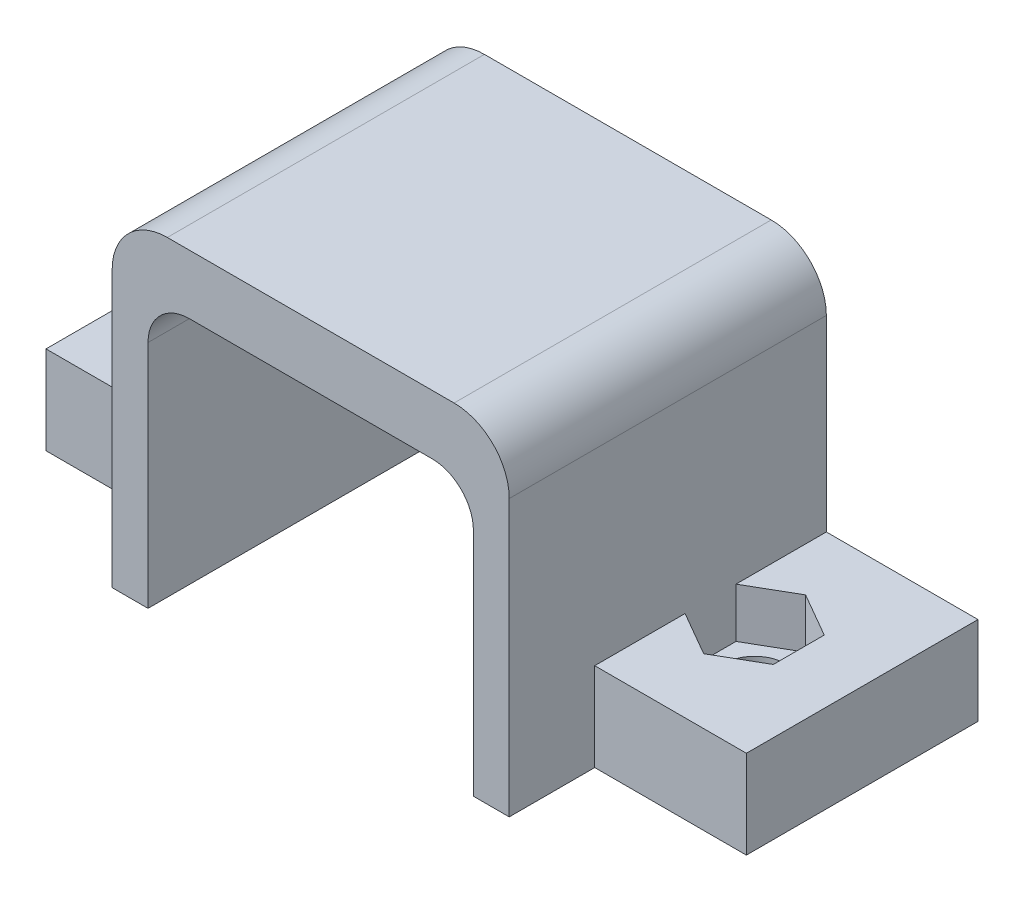
ISO-10303-21;
HEADER;
FILE_DESCRIPTION(('STEP AP214'),'2;1');
FILE_NAME('part.step','',(''),(''),'','','');
FILE_SCHEMA(('AUTOMOTIVE_DESIGN { 1 0 10303 214 1 1 1 1 }'));
ENDSEC;
DATA;
#1=APPLICATION_CONTEXT('core data for automotive mechanical design processes');
#2=APPLICATION_PROTOCOL_DEFINITION('international standard','automotive_design',2000,#1);
#3=PRODUCT_CONTEXT('',#1,'mechanical');
#4=PRODUCT('Part','Part','',(#3));
#5=PRODUCT_RELATED_PRODUCT_CATEGORY('part','',(#4));
#6=PRODUCT_DEFINITION_FORMATION('','',#4);
#7=PRODUCT_DEFINITION_CONTEXT('part definition',#1,'design');
#8=PRODUCT_DEFINITION('design','',#6,#7);
#9=PRODUCT_DEFINITION_SHAPE('','',#8);
#10=(LENGTH_UNIT() NAMED_UNIT(*) SI_UNIT(.MILLI.,.METRE.));
#11=(NAMED_UNIT(*) PLANE_ANGLE_UNIT() SI_UNIT($,.RADIAN.));
#12=(NAMED_UNIT(*) SI_UNIT($,.STERADIAN.) SOLID_ANGLE_UNIT());
#13=UNCERTAINTY_MEASURE_WITH_UNIT(LENGTH_MEASURE(1.E-05),#10,'distance_accuracy_value','');
#14=(GEOMETRIC_REPRESENTATION_CONTEXT(3) GLOBAL_UNCERTAINTY_ASSIGNED_CONTEXT((#13)) GLOBAL_UNIT_ASSIGNED_CONTEXT((#10,
#11,#12)) REPRESENTATION_CONTEXT('',''));
#15=CARTESIAN_POINT('',(0.,0.,0.));
#16=DIRECTION('',(0.,0.,1.));
#17=DIRECTION('',(1.,0.,0.));
#18=AXIS2_PLACEMENT_3D('',#15,#16,#17);
#19=CARTESIAN_POINT('',(16.,0.,4.2));
#20=DIRECTION('',(0.,1.,0.));
#21=DIRECTION('',(0.,0.,1.));
#22=AXIS2_PLACEMENT_3D('',#19,#20,#21);
#23=CYLINDRICAL_SURFACE('',#22,1.125);
#24=CARTESIAN_POINT('',(16.,0.,4.2));
#25=DIRECTION('',(0.,1.,0.));
#26=DIRECTION('',(0.,0.,1.));
#27=AXIS2_PLACEMENT_3D('',#24,#25,#26);
#28=CIRCLE('',#27,1.125);
#29=CARTESIAN_POINT('',(16.,0.,5.325));
#30=VERTEX_POINT('',#29);
#31=EDGE_CURVE('E382',#30,#30,#28,.T.);
#32=ORIENTED_EDGE('',*,*,#31,.F.);
#33=EDGE_LOOP('',(#32));
#34=FACE_BOUND('',#33,.T.);
#35=CARTESIAN_POINT('',(16.,1.4,4.2));
#36=DIRECTION('',(0.,1.,0.));
#37=DIRECTION('',(0.,0.,1.));
#38=AXIS2_PLACEMENT_3D('',#35,#36,#37);
#39=CIRCLE('',#38,1.125);
#40=CARTESIAN_POINT('',(16.,1.4,5.325));
#41=VERTEX_POINT('',#40);
#42=EDGE_CURVE('E386',#41,#41,#39,.F.);
#43=ORIENTED_EDGE('',*,*,#42,.F.);
#44=EDGE_LOOP('',(#43));
#45=FACE_BOUND('',#44,.T.);
#46=ADVANCED_FACE('F43',(#34,#45),#23,.F.);
#47=CARTESIAN_POINT('',(-1.6,0.,4.2));
#48=DIRECTION('',(0.,1.,0.));
#49=DIRECTION('',(0.,0.,1.));
#50=AXIS2_PLACEMENT_3D('',#47,#48,#49);
#51=CYLINDRICAL_SURFACE('',#50,1.125);
#52=CARTESIAN_POINT('',(-1.6,0.,4.2));
#53=DIRECTION('',(0.,1.,0.));
#54=DIRECTION('',(0.,0.,1.));
#55=AXIS2_PLACEMENT_3D('',#52,#53,#54);
#56=CIRCLE('',#55,1.125);
#57=CARTESIAN_POINT('',(-1.6,0.,5.325));
#58=VERTEX_POINT('',#57);
#59=EDGE_CURVE('E377',#58,#58,#56,.T.);
#60=ORIENTED_EDGE('',*,*,#59,.F.);
#61=EDGE_LOOP('',(#60));
#62=FACE_BOUND('',#61,.T.);
#63=CARTESIAN_POINT('',(-1.6,1.4,4.2));
#64=DIRECTION('',(0.,1.,0.));
#65=DIRECTION('',(0.,0.,1.));
#66=AXIS2_PLACEMENT_3D('',#63,#64,#65);
#67=CIRCLE('',#66,1.125);
#68=CARTESIAN_POINT('',(-1.6,1.4,5.325));
#69=VERTEX_POINT('',#68);
#70=EDGE_CURVE('E304',#69,#69,#67,.F.);
#71=ORIENTED_EDGE('',*,*,#70,.F.);
#72=EDGE_LOOP('',(#71));
#73=FACE_BOUND('',#72,.T.);
#74=ADVANCED_FACE('F690',(#62,#73),#51,.F.);
#75=CARTESIAN_POINT('',(14.4,0.,11.5));
#76=DIRECTION('',(-1.,0.,0.));
#77=DIRECTION('',(0.,0.,1.));
#78=AXIS2_PLACEMENT_3D('',#75,#76,#77);
#79=PLANE('',#78);
#80=DIRECTION('',(0.,1.,0.));
#81=VECTOR('',#80,1.);
#82=CARTESIAN_POINT('',(14.4,0.,0.));
#83=LINE('',#82,#81);
#84=CARTESIAN_POINT('',(14.4,3.2,0.));
#85=VERTEX_POINT('',#84);
#86=CARTESIAN_POINT('',(14.4,10.,0.));
#87=VERTEX_POINT('',#86);
#88=EDGE_CURVE('E505',#85,#87,#83,.T.);
#89=ORIENTED_EDGE('',*,*,#88,.T.);
#90=DIRECTION('',(0.,0.,-1.));
#91=VECTOR('',#90,1.);
#92=CARTESIAN_POINT('',(14.4,10.,11.5));
#93=LINE('',#92,#91);
#94=CARTESIAN_POINT('',(14.4,10.,11.5));
#95=VERTEX_POINT('',#94);
#96=EDGE_CURVE('E546',#87,#95,#93,.F.);
#97=ORIENTED_EDGE('',*,*,#96,.T.);
#98=DIRECTION('',(0.,1.,0.));
#99=VECTOR('',#98,1.);
#100=CARTESIAN_POINT('',(14.4,0.,11.5));
#101=LINE('',#100,#99);
#102=CARTESIAN_POINT('',(14.4,0.,11.5));
#103=VERTEX_POINT('',#102);
#104=EDGE_CURVE('E478',#103,#95,#101,.T.);
#105=ORIENTED_EDGE('',*,*,#104,.F.);
#106=DIRECTION('',(0.,0.,-1.));
#107=VECTOR('',#106,1.);
#108=CARTESIAN_POINT('',(14.4,0.,11.5));
#109=LINE('',#108,#107);
#110=CARTESIAN_POINT('',(14.4,0.,8.4));
#111=VERTEX_POINT('',#110);
#112=EDGE_CURVE('E486',#103,#111,#109,.T.);
#113=ORIENTED_EDGE('',*,*,#112,.T.);
#114=DIRECTION('',(0.,-1.,0.));
#115=VECTOR('',#114,1.);
#116=CARTESIAN_POINT('',(14.4,3.2,8.4));
#117=LINE('',#116,#115);
#118=CARTESIAN_POINT('',(14.4,3.2,8.4));
#119=VERTEX_POINT('',#118);
#120=EDGE_CURVE('E381',#119,#111,#117,.T.);
#121=ORIENTED_EDGE('',*,*,#120,.F.);
#122=DIRECTION('',(0.,0.,-1.));
#123=VECTOR('',#122,1.);
#124=CARTESIAN_POINT('',(14.4,3.2,0.));
#125=LINE('',#124,#123);
#126=CARTESIAN_POINT('',(14.4,3.2,5.1237604307034));
#127=VERTEX_POINT('',#126);
#128=EDGE_CURVE('E402',#119,#127,#125,.T.);
#129=ORIENTED_EDGE('',*,*,#128,.T.);
#130=DIRECTION('',(0.,1.,0.));
#131=VECTOR('',#130,1.);
#132=CARTESIAN_POINT('',(14.4,1.4,5.1237604307034));
#133=LINE('',#132,#131);
#134=CARTESIAN_POINT('',(14.4,1.4,5.1237604307034));
#135=VERTEX_POINT('',#134);
#136=EDGE_CURVE('E324',#135,#127,#133,.T.);
#137=ORIENTED_EDGE('',*,*,#136,.F.);
#138=DIRECTION('',(0.,0.,1.));
#139=VECTOR('',#138,1.);
#140=CARTESIAN_POINT('',(14.4,1.4,3.2762395692966));
#141=LINE('',#140,#139);
#142=CARTESIAN_POINT('',(14.4,1.4,3.2762395692966));
#143=VERTEX_POINT('',#142);
#144=EDGE_CURVE('E366',#143,#135,#141,.T.);
#145=ORIENTED_EDGE('',*,*,#144,.F.);
#146=DIRECTION('',(0.,1.,0.));
#147=VECTOR('',#146,1.);
#148=CARTESIAN_POINT('',(14.4,1.4,3.2762395692966));
#149=LINE('',#148,#147);
#150=CARTESIAN_POINT('',(14.4,3.2,3.2762395692966));
#151=VERTEX_POINT('',#150);
#152=EDGE_CURVE('E321',#143,#151,#149,.T.);
#153=ORIENTED_EDGE('',*,*,#152,.T.);
#154=EDGE_CURVE('E418',#151,#85,#125,.T.);
#155=ORIENTED_EDGE('',*,*,#154,.T.);
#156=EDGE_LOOP('',(#89,#97,#105,#113,#121,#129,#137,#145,#153,#155));
#157=FACE_BOUND('',#156,.T.);
#158=ADVANCED_FACE('F583',(#157),#79,.F.);
#159=CARTESIAN_POINT('',(0.,0.,11.5));
#160=DIRECTION('',(1.,0.,0.));
#161=DIRECTION('',(0.,0.,-1.));
#162=AXIS2_PLACEMENT_3D('',#159,#160,#161);
#163=PLANE('',#162);
#164=DIRECTION('',(0.,-1.,0.));
#165=VECTOR('',#164,1.);
#166=CARTESIAN_POINT('',(0.,0.,11.5));
#167=LINE('',#166,#165);
#168=CARTESIAN_POINT('',(0.,10.,11.5));
#169=VERTEX_POINT('',#168);
#170=CARTESIAN_POINT('',(0.,0.,11.5));
#171=VERTEX_POINT('',#170);
#172=EDGE_CURVE('E458',#169,#171,#167,.T.);
#173=ORIENTED_EDGE('',*,*,#172,.F.);
#174=DIRECTION('',(0.,0.,-1.));
#175=VECTOR('',#174,1.);
#176=CARTESIAN_POINT('',(0.,10.,11.5));
#177=LINE('',#176,#175);
#178=CARTESIAN_POINT('',(0.,10.,0.));
#179=VERTEX_POINT('',#178);
#180=EDGE_CURVE('E555',#169,#179,#177,.T.);
#181=ORIENTED_EDGE('',*,*,#180,.T.);
#182=DIRECTION('',(0.,-1.,0.));
#183=VECTOR('',#182,1.);
#184=CARTESIAN_POINT('',(0.,0.,0.));
#185=LINE('',#184,#183);
#186=CARTESIAN_POINT('',(0.,3.2,0.));
#187=VERTEX_POINT('',#186);
#188=EDGE_CURVE('E451',#179,#187,#185,.T.);
#189=ORIENTED_EDGE('',*,*,#188,.T.);
#190=DIRECTION('',(0.,0.,1.));
#191=VECTOR('',#190,1.);
#192=CARTESIAN_POINT('',(0.,3.2,0.));
#193=LINE('',#192,#191);
#194=CARTESIAN_POINT('',(0.,3.2,3.2762395692966));
#195=VERTEX_POINT('',#194);
#196=EDGE_CURVE('E422',#187,#195,#193,.T.);
#197=ORIENTED_EDGE('',*,*,#196,.T.);
#198=DIRECTION('',(0.,1.,0.));
#199=VECTOR('',#198,1.);
#200=CARTESIAN_POINT('',(0.,1.4,3.2762395692966));
#201=LINE('',#200,#199);
#202=CARTESIAN_POINT('',(0.,1.4,3.2762395692966));
#203=VERTEX_POINT('',#202);
#204=EDGE_CURVE('E301',#203,#195,#201,.T.);
#205=ORIENTED_EDGE('',*,*,#204,.F.);
#206=DIRECTION('',(0.,0.,-1.));
#207=VECTOR('',#206,1.);
#208=CARTESIAN_POINT('',(0.,1.4,5.12376043070341));
#209=LINE('',#208,#207);
#210=CARTESIAN_POINT('',(0.,1.4,5.12376043070341));
#211=VERTEX_POINT('',#210);
#212=EDGE_CURVE('E254',#211,#203,#209,.T.);
#213=ORIENTED_EDGE('',*,*,#212,.F.);
#214=DIRECTION('',(0.,1.,0.));
#215=VECTOR('',#214,1.);
#216=CARTESIAN_POINT('',(0.,1.4,5.12376043070341));
#217=LINE('',#216,#215);
#218=CARTESIAN_POINT('',(0.,3.2,5.12376043070341));
#219=VERTEX_POINT('',#218);
#220=EDGE_CURVE('E305',#211,#219,#217,.T.);
#221=ORIENTED_EDGE('',*,*,#220,.T.);
#222=CARTESIAN_POINT('',(0.,3.2,8.4));
#223=VERTEX_POINT('',#222);
#224=EDGE_CURVE('E427',#219,#223,#193,.T.);
#225=ORIENTED_EDGE('',*,*,#224,.T.);
#226=DIRECTION('',(0.,-1.,0.));
#227=VECTOR('',#226,1.);
#228=CARTESIAN_POINT('',(0.,3.2,8.4));
#229=LINE('',#228,#227);
#230=CARTESIAN_POINT('',(0.,0.,8.4));
#231=VERTEX_POINT('',#230);
#232=EDGE_CURVE('E439',#223,#231,#229,.T.);
#233=ORIENTED_EDGE('',*,*,#232,.T.);
#234=DIRECTION('',(0.,0.,-1.));
#235=VECTOR('',#234,1.);
#236=CARTESIAN_POINT('',(0.,0.,11.5));
#237=LINE('',#236,#235);
#238=EDGE_CURVE('E523',#171,#231,#237,.T.);
#239=ORIENTED_EDGE('',*,*,#238,.F.);
#240=EDGE_LOOP('',(#173,#181,#189,#197,#205,#213,#221,#225,#233,#239));
#241=FACE_BOUND('',#240,.T.);
#242=ADVANCED_FACE('F612',(#241),#163,.F.);
#243=CARTESIAN_POINT('',(0.,0.,11.5));
#244=DIRECTION('',(0.,1.,0.));
#245=DIRECTION('',(0.,0.,1.));
#246=AXIS2_PLACEMENT_3D('',#243,#244,#245);
#247=PLANE('',#246);
#248=ORIENTED_EDGE('',*,*,#59,.T.);
#249=EDGE_LOOP('',(#248));
#250=FACE_BOUND('',#249,.T.);
#251=DIRECTION('',(1.,0.,0.));
#252=VECTOR('',#251,1.);
#253=CARTESIAN_POINT('',(0.,0.,0.));
#254=LINE('',#253,#252);
#255=CARTESIAN_POINT('',(-5.5,0.,0.));
#256=VERTEX_POINT('',#255);
#257=CARTESIAN_POINT('',(1.3,0.,0.));
#258=VERTEX_POINT('',#257);
#259=EDGE_CURVE('E489',#256,#258,#254,.T.);
#260=ORIENTED_EDGE('',*,*,#259,.T.);
#261=DIRECTION('',(0.,0.,-1.));
#262=VECTOR('',#261,1.);
#263=CARTESIAN_POINT('',(1.3,0.,11.5));
#264=LINE('',#263,#262);
#265=CARTESIAN_POINT('',(1.3,0.,11.5));
#266=VERTEX_POINT('',#265);
#267=EDGE_CURVE('E519',#266,#258,#264,.T.);
#268=ORIENTED_EDGE('',*,*,#267,.F.);
#269=DIRECTION('',(1.,0.,0.));
#270=VECTOR('',#269,1.);
#271=CARTESIAN_POINT('',(0.,0.,11.5));
#272=LINE('',#271,#270);
#273=EDGE_CURVE('E461',#171,#266,#272,.T.);
#274=ORIENTED_EDGE('',*,*,#273,.F.);
#275=ORIENTED_EDGE('',*,*,#238,.T.);
#276=DIRECTION('',(-1.,0.,0.));
#277=VECTOR('',#276,1.);
#278=CARTESIAN_POINT('',(0.,0.,8.4));
#279=LINE('',#278,#277);
#280=CARTESIAN_POINT('',(-5.5,0.,8.4));
#281=VERTEX_POINT('',#280);
#282=EDGE_CURVE('E406',#231,#281,#279,.T.);
#283=ORIENTED_EDGE('',*,*,#282,.T.);
#284=DIRECTION('',(0.,0.,-1.));
#285=VECTOR('',#284,1.);
#286=CARTESIAN_POINT('',(-5.5,0.,0.));
#287=LINE('',#286,#285);
#288=EDGE_CURVE('E443',#281,#256,#287,.T.);
#289=ORIENTED_EDGE('',*,*,#288,.T.);
#290=EDGE_LOOP('',(#260,#268,#274,#275,#283,#289));
#291=FACE_BOUND('',#290,.T.);
#292=ADVANCED_FACE('F632',(#250,#291),#247,.F.);
#293=CARTESIAN_POINT('',(1.3,0.,11.5));
#294=DIRECTION('',(-1.,0.,0.));
#295=DIRECTION('',(0.,0.,1.));
#296=AXIS2_PLACEMENT_3D('',#293,#294,#295);
#297=PLANE('',#296);
#298=DIRECTION('',(0.,1.,0.));
#299=VECTOR('',#298,1.);
#300=CARTESIAN_POINT('',(1.3,0.,0.));
#301=LINE('',#300,#299);
#302=CARTESIAN_POINT('',(1.3,8.35,0.));
#303=VERTEX_POINT('',#302);
#304=EDGE_CURVE('E492',#258,#303,#301,.T.);
#305=ORIENTED_EDGE('',*,*,#304,.T.);
#306=DIRECTION('',(0.,0.,-1.));
#307=VECTOR('',#306,1.);
#308=CARTESIAN_POINT('',(1.3,8.35,11.5));
#309=LINE('',#308,#307);
#310=CARTESIAN_POINT('',(1.3,8.35,11.5));
#311=VERTEX_POINT('',#310);
#312=EDGE_CURVE('E59',#303,#311,#309,.F.);
#313=ORIENTED_EDGE('',*,*,#312,.T.);
#314=DIRECTION('',(0.,1.,0.));
#315=VECTOR('',#314,1.);
#316=CARTESIAN_POINT('',(1.3,0.,11.5));
#317=LINE('',#316,#315);
#318=EDGE_CURVE('E465',#266,#311,#317,.T.);
#319=ORIENTED_EDGE('',*,*,#318,.F.);
#320=ORIENTED_EDGE('',*,*,#267,.T.);
#321=EDGE_LOOP('',(#305,#313,#319,#320));
#322=FACE_BOUND('',#321,.T.);
#323=ADVANCED_FACE('F733',(#322),#297,.F.);
#324=CARTESIAN_POINT('',(1.3,9.85,11.5));
#325=DIRECTION('',(0.,1.,0.));
#326=DIRECTION('',(0.,0.,1.));
#327=AXIS2_PLACEMENT_3D('',#324,#325,#326);
#328=PLANE('',#327);
#329=DIRECTION('',(1.,0.,0.));
#330=VECTOR('',#329,1.);
#331=CARTESIAN_POINT('',(1.3,9.85,0.));
#332=LINE('',#331,#330);
#333=CARTESIAN_POINT('',(2.8,9.85,0.));
#334=VERTEX_POINT('',#333);
#335=CARTESIAN_POINT('',(11.6,9.85,0.));
#336=VERTEX_POINT('',#335);
#337=EDGE_CURVE('E495',#334,#336,#332,.T.);
#338=ORIENTED_EDGE('',*,*,#337,.T.);
#339=DIRECTION('',(0.,0.,-1.));
#340=VECTOR('',#339,1.);
#341=CARTESIAN_POINT('',(11.6,9.85,11.5));
#342=LINE('',#341,#340);
#343=CARTESIAN_POINT('',(11.6,9.85,11.5));
#344=VERTEX_POINT('',#343);
#345=EDGE_CURVE('E567',#336,#344,#342,.F.);
#346=ORIENTED_EDGE('',*,*,#345,.T.);
#347=DIRECTION('',(1.,0.,0.));
#348=VECTOR('',#347,1.);
#349=CARTESIAN_POINT('',(1.3,9.85,11.5));
#350=LINE('',#349,#348);
#351=CARTESIAN_POINT('',(2.8,9.85,11.5));
#352=VERTEX_POINT('',#351);
#353=EDGE_CURVE('E468',#352,#344,#350,.T.);
#354=ORIENTED_EDGE('',*,*,#353,.F.);
#355=DIRECTION('',(0.,0.,-1.));
#356=VECTOR('',#355,1.);
#357=CARTESIAN_POINT('',(2.8,9.85,0.));
#358=LINE('',#357,#356);
#359=EDGE_CURVE('E563',#352,#334,#358,.T.);
#360=ORIENTED_EDGE('',*,*,#359,.T.);
#361=EDGE_LOOP('',(#338,#346,#354,#360));
#362=FACE_BOUND('',#361,.T.);
#363=ADVANCED_FACE('F639',(#362),#328,.F.);
#364=CARTESIAN_POINT('',(13.1,0.,11.5));
#365=DIRECTION('',(1.,0.,0.));
#366=DIRECTION('',(0.,0.,-1.));
#367=AXIS2_PLACEMENT_3D('',#364,#365,#366);
#368=PLANE('',#367);
#369=DIRECTION('',(0.,-1.,0.));
#370=VECTOR('',#369,1.);
#371=CARTESIAN_POINT('',(13.1,0.,11.5));
#372=LINE('',#371,#370);
#373=CARTESIAN_POINT('',(13.1,8.35,11.5));
#374=VERTEX_POINT('',#373);
#375=CARTESIAN_POINT('',(13.1,0.,11.5));
#376=VERTEX_POINT('',#375);
#377=EDGE_CURVE('E472',#374,#376,#372,.T.);
#378=ORIENTED_EDGE('',*,*,#377,.F.);
#379=DIRECTION('',(0.,0.,-1.));
#380=VECTOR('',#379,1.);
#381=CARTESIAN_POINT('',(13.1,8.35,0.));
#382=LINE('',#381,#380);
#383=CARTESIAN_POINT('',(13.1,8.35,0.));
#384=VERTEX_POINT('',#383);
#385=EDGE_CURVE('E559',#374,#384,#382,.T.);
#386=ORIENTED_EDGE('',*,*,#385,.T.);
#387=DIRECTION('',(0.,-1.,0.));
#388=VECTOR('',#387,1.);
#389=CARTESIAN_POINT('',(13.1,0.,0.));
#390=LINE('',#389,#388);
#391=CARTESIAN_POINT('',(13.1,0.,0.));
#392=VERTEX_POINT('',#391);
#393=EDGE_CURVE('E499',#384,#392,#390,.T.);
#394=ORIENTED_EDGE('',*,*,#393,.T.);
#395=DIRECTION('',(0.,0.,-1.));
#396=VECTOR('',#395,1.);
#397=CARTESIAN_POINT('',(13.1,0.,11.5));
#398=LINE('',#397,#396);
#399=EDGE_CURVE('E515',#376,#392,#398,.T.);
#400=ORIENTED_EDGE('',*,*,#399,.F.);
#401=EDGE_LOOP('',(#378,#386,#394,#400));
#402=FACE_BOUND('',#401,.T.);
#403=ADVANCED_FACE('F649',(#402),#368,.F.);
#404=CARTESIAN_POINT('',(13.1,0.,11.5));
#405=DIRECTION('',(0.,1.,0.));
#406=DIRECTION('',(0.,0.,1.));
#407=AXIS2_PLACEMENT_3D('',#404,#405,#406);
#408=PLANE('',#407);
#409=ORIENTED_EDGE('',*,*,#31,.T.);
#410=EDGE_LOOP('',(#409));
#411=FACE_BOUND('',#410,.T.);
#412=DIRECTION('',(1.,0.,0.));
#413=VECTOR('',#412,1.);
#414=CARTESIAN_POINT('',(13.1,0.,0.));
#415=LINE('',#414,#413);
#416=CARTESIAN_POINT('',(19.9,0.,0.));
#417=VERTEX_POINT('',#416);
#418=EDGE_CURVE('E502',#392,#417,#415,.T.);
#419=ORIENTED_EDGE('',*,*,#418,.T.);
#420=DIRECTION('',(0.,0.,1.));
#421=VECTOR('',#420,1.);
#422=CARTESIAN_POINT('',(19.9,0.,0.));
#423=LINE('',#422,#421);
#424=CARTESIAN_POINT('',(19.9,0.,8.4));
#425=VERTEX_POINT('',#424);
#426=EDGE_CURVE('E401',#417,#425,#423,.T.);
#427=ORIENTED_EDGE('',*,*,#426,.T.);
#428=DIRECTION('',(-1.,0.,0.));
#429=VECTOR('',#428,1.);
#430=CARTESIAN_POINT('',(14.4,0.,8.4));
#431=LINE('',#430,#429);
#432=EDGE_CURVE('E397',#425,#111,#431,.T.);
#433=ORIENTED_EDGE('',*,*,#432,.T.);
#434=ORIENTED_EDGE('',*,*,#112,.F.);
#435=DIRECTION('',(1.,0.,0.));
#436=VECTOR('',#435,1.);
#437=CARTESIAN_POINT('',(13.1,0.,11.5));
#438=LINE('',#437,#436);
#439=EDGE_CURVE('E475',#376,#103,#438,.T.);
#440=ORIENTED_EDGE('',*,*,#439,.F.);
#441=ORIENTED_EDGE('',*,*,#399,.T.);
#442=EDGE_LOOP('',(#419,#427,#433,#434,#440,#441));
#443=FACE_BOUND('',#442,.T.);
#444=ADVANCED_FACE('F655',(#411,#443),#408,.F.);
#445=CARTESIAN_POINT('',(0.,12.,11.5));
#446=DIRECTION('',(0.,-1.,0.));
#447=DIRECTION('',(0.,0.,-1.));
#448=AXIS2_PLACEMENT_3D('',#445,#446,#447);
#449=PLANE('',#448);
#450=DIRECTION('',(-1.,0.,0.));
#451=VECTOR('',#450,1.);
#452=CARTESIAN_POINT('',(0.,12.,11.5));
#453=LINE('',#452,#451);
#454=CARTESIAN_POINT('',(12.4,12.,11.5));
#455=VERTEX_POINT('',#454);
#456=CARTESIAN_POINT('',(2.,12.,11.5));
#457=VERTEX_POINT('',#456);
#458=EDGE_CURVE('E482',#455,#457,#453,.T.);
#459=ORIENTED_EDGE('',*,*,#458,.F.);
#460=DIRECTION('',(0.,0.,-1.));
#461=VECTOR('',#460,1.);
#462=CARTESIAN_POINT('',(12.4,12.,11.5));
#463=LINE('',#462,#461);
#464=CARTESIAN_POINT('',(12.4,12.,0.));
#465=VERTEX_POINT('',#464);
#466=EDGE_CURVE('E536',#455,#465,#463,.T.);
#467=ORIENTED_EDGE('',*,*,#466,.T.);
#468=DIRECTION('',(-1.,0.,0.));
#469=VECTOR('',#468,1.);
#470=CARTESIAN_POINT('',(0.,12.,0.));
#471=LINE('',#470,#469);
#472=CARTESIAN_POINT('',(2.,12.,0.));
#473=VERTEX_POINT('',#472);
#474=EDGE_CURVE('E462',#465,#473,#471,.T.);
#475=ORIENTED_EDGE('',*,*,#474,.T.);
#476=DIRECTION('',(0.,0.,-1.));
#477=VECTOR('',#476,1.);
#478=CARTESIAN_POINT('',(2.,12.,11.5));
#479=LINE('',#478,#477);
#480=EDGE_CURVE('E527',#473,#457,#479,.F.);
#481=ORIENTED_EDGE('',*,*,#480,.T.);
#482=EDGE_LOOP('',(#459,#467,#475,#481));
#483=FACE_BOUND('',#482,.T.);
#484=ADVANCED_FACE('F601',(#483),#449,.F.);
#485=CARTESIAN_POINT('',(0.,0.,11.5));
#486=DIRECTION('',(0.,0.,-1.));
#487=DIRECTION('',(-1.,0.,0.));
#488=AXIS2_PLACEMENT_3D('',#485,#486,#487);
#489=PLANE('',#488);
#490=ORIENTED_EDGE('',*,*,#104,.T.);
#491=CARTESIAN_POINT('',(12.4,10.,11.5));
#492=DIRECTION('',(0.,0.,-1.));
#493=DIRECTION('',(-1.,0.,0.));
#494=AXIS2_PLACEMENT_3D('',#491,#492,#493);
#495=CIRCLE('',#494,2.);
#496=EDGE_CURVE('E552',#95,#455,#495,.F.);
#497=ORIENTED_EDGE('',*,*,#496,.T.);
#498=ORIENTED_EDGE('',*,*,#458,.T.);
#499=CARTESIAN_POINT('',(2.,10.,11.5));
#500=DIRECTION('',(0.,0.,-1.));
#501=DIRECTION('',(-1.,0.,0.));
#502=AXIS2_PLACEMENT_3D('',#499,#500,#501);
#503=CIRCLE('',#502,2.);
#504=EDGE_CURVE('E549',#457,#169,#503,.F.);
#505=ORIENTED_EDGE('',*,*,#504,.T.);
#506=ORIENTED_EDGE('',*,*,#172,.T.);
#507=ORIENTED_EDGE('',*,*,#273,.T.);
#508=ORIENTED_EDGE('',*,*,#318,.T.);
#509=CARTESIAN_POINT('',(2.8,8.35,11.5));
#510=DIRECTION('',(0.,0.,-1.));
#511=DIRECTION('',(-1.,0.,0.));
#512=AXIS2_PLACEMENT_3D('',#509,#510,#511);
#513=CIRCLE('',#512,1.5);
#514=EDGE_CURVE('E11',#311,#352,#513,.T.);
#515=ORIENTED_EDGE('',*,*,#514,.T.);
#516=ORIENTED_EDGE('',*,*,#353,.T.);
#517=CARTESIAN_POINT('',(11.6,8.35,11.5));
#518=DIRECTION('',(0.,0.,-1.));
#519=DIRECTION('',(-1.,0.,0.));
#520=AXIS2_PLACEMENT_3D('',#517,#518,#519);
#521=CIRCLE('',#520,1.5);
#522=EDGE_CURVE('E575',#344,#374,#521,.T.);
#523=ORIENTED_EDGE('',*,*,#522,.T.);
#524=ORIENTED_EDGE('',*,*,#377,.T.);
#525=ORIENTED_EDGE('',*,*,#439,.T.);
#526=EDGE_LOOP('',(#490,#497,#498,#505,#506,#507,#508,#515,#516,#523,#524,#525));
#527=FACE_BOUND('',#526,.T.);
#528=ADVANCED_FACE('F605',(#527),#489,.F.);
#529=CARTESIAN_POINT('',(0.,0.,0.));
#530=DIRECTION('',(0.,0.,-1.));
#531=DIRECTION('',(-1.,0.,0.));
#532=AXIS2_PLACEMENT_3D('',#529,#530,#531);
#533=PLANE('',#532);
#534=ORIENTED_EDGE('',*,*,#474,.F.);
#535=CARTESIAN_POINT('',(12.4,10.,0.));
#536=DIRECTION('',(0.,0.,-1.));
#537=DIRECTION('',(-1.,0.,0.));
#538=AXIS2_PLACEMENT_3D('',#535,#536,#537);
#539=CIRCLE('',#538,2.);
#540=EDGE_CURVE('E543',#465,#87,#539,.T.);
#541=ORIENTED_EDGE('',*,*,#540,.T.);
#542=ORIENTED_EDGE('',*,*,#88,.F.);
#543=DIRECTION('',(1.,0.,0.));
#544=VECTOR('',#543,1.);
#545=CARTESIAN_POINT('',(14.4,3.2,0.));
#546=LINE('',#545,#544);
#547=CARTESIAN_POINT('',(19.9,3.2,0.));
#548=VERTEX_POINT('',#547);
#549=EDGE_CURVE('E414',#85,#548,#546,.T.);
#550=ORIENTED_EDGE('',*,*,#549,.T.);
#551=DIRECTION('',(0.,-1.,0.));
#552=VECTOR('',#551,1.);
#553=CARTESIAN_POINT('',(19.9,3.2,0.));
#554=LINE('',#553,#552);
#555=EDGE_CURVE('E387',#548,#417,#554,.T.);
#556=ORIENTED_EDGE('',*,*,#555,.T.);
#557=ORIENTED_EDGE('',*,*,#418,.F.);
#558=ORIENTED_EDGE('',*,*,#393,.F.);
#559=CARTESIAN_POINT('',(11.6,8.35,0.));
#560=DIRECTION('',(0.,0.,-1.));
#561=DIRECTION('',(-1.,0.,0.));
#562=AXIS2_PLACEMENT_3D('',#559,#560,#561);
#563=CIRCLE('',#562,1.5);
#564=EDGE_CURVE('E572',#384,#336,#563,.F.);
#565=ORIENTED_EDGE('',*,*,#564,.T.);
#566=ORIENTED_EDGE('',*,*,#337,.F.);
#567=CARTESIAN_POINT('',(2.8,8.35,0.));
#568=DIRECTION('',(0.,0.,-1.));
#569=DIRECTION('',(-1.,0.,0.));
#570=AXIS2_PLACEMENT_3D('',#567,#568,#569);
#571=CIRCLE('',#570,1.5);
#572=EDGE_CURVE('E52',#334,#303,#571,.F.);
#573=ORIENTED_EDGE('',*,*,#572,.T.);
#574=ORIENTED_EDGE('',*,*,#304,.F.);
#575=ORIENTED_EDGE('',*,*,#259,.F.);
#576=DIRECTION('',(0.,-1.,0.));
#577=VECTOR('',#576,1.);
#578=CARTESIAN_POINT('',(-5.5,3.2,0.));
#579=LINE('',#578,#577);
#580=CARTESIAN_POINT('',(-5.5,3.2,0.));
#581=VERTEX_POINT('',#580);
#582=EDGE_CURVE('E447',#581,#256,#579,.T.);
#583=ORIENTED_EDGE('',*,*,#582,.F.);
#584=DIRECTION('',(1.,0.,0.));
#585=VECTOR('',#584,1.);
#586=CARTESIAN_POINT('',(0.,3.2,0.));
#587=LINE('',#586,#585);
#588=EDGE_CURVE('E435',#581,#187,#587,.T.);
#589=ORIENTED_EDGE('',*,*,#588,.T.);
#590=ORIENTED_EDGE('',*,*,#188,.F.);
#591=CARTESIAN_POINT('',(2.,10.,0.));
#592=DIRECTION('',(0.,0.,-1.));
#593=DIRECTION('',(-1.,0.,0.));
#594=AXIS2_PLACEMENT_3D('',#591,#592,#593);
#595=CIRCLE('',#594,2.);
#596=EDGE_CURVE('E540',#179,#473,#595,.T.);
#597=ORIENTED_EDGE('',*,*,#596,.T.);
#598=EDGE_LOOP('',(#534,#541,#542,#550,#556,#557,#558,#565,#566,#573,#574,#575,#583,#589,#590,#597));
#599=FACE_BOUND('',#598,.T.);
#600=ADVANCED_FACE('F594',(#599),#533,.T.);
#601=CARTESIAN_POINT('',(-5.5,3.2,0.));
#602=DIRECTION('',(-1.,0.,0.));
#603=DIRECTION('',(0.,0.,1.));
#604=AXIS2_PLACEMENT_3D('',#601,#602,#603);
#605=PLANE('',#604);
#606=ORIENTED_EDGE('',*,*,#288,.F.);
#607=DIRECTION('',(0.,-1.,0.));
#608=VECTOR('',#607,1.);
#609=CARTESIAN_POINT('',(-5.5,3.2,8.4));
#610=LINE('',#609,#608);
#611=CARTESIAN_POINT('',(-5.5,3.2,8.4));
#612=VERTEX_POINT('',#611);
#613=EDGE_CURVE('E452',#612,#281,#610,.T.);
#614=ORIENTED_EDGE('',*,*,#613,.F.);
#615=DIRECTION('',(0.,0.,-1.));
#616=VECTOR('',#615,1.);
#617=CARTESIAN_POINT('',(-5.5,3.2,0.));
#618=LINE('',#617,#616);
#619=EDGE_CURVE('E431',#612,#581,#618,.T.);
#620=ORIENTED_EDGE('',*,*,#619,.T.);
#621=ORIENTED_EDGE('',*,*,#582,.T.);
#622=EDGE_LOOP('',(#606,#614,#620,#621));
#623=FACE_BOUND('',#622,.T.);
#624=ADVANCED_FACE('F712',(#623),#605,.T.);
#625=CARTESIAN_POINT('',(0.,3.2,8.4));
#626=DIRECTION('',(0.,0.,1.));
#627=DIRECTION('',(1.,0.,0.));
#628=AXIS2_PLACEMENT_3D('',#625,#626,#627);
#629=PLANE('',#628);
#630=ORIENTED_EDGE('',*,*,#282,.F.);
#631=ORIENTED_EDGE('',*,*,#232,.F.);
#632=DIRECTION('',(-1.,0.,0.));
#633=VECTOR('',#632,1.);
#634=CARTESIAN_POINT('',(0.,3.2,8.4));
#635=LINE('',#634,#633);
#636=EDGE_CURVE('E426',#223,#612,#635,.T.);
#637=ORIENTED_EDGE('',*,*,#636,.T.);
#638=ORIENTED_EDGE('',*,*,#613,.T.);
#639=EDGE_LOOP('',(#630,#631,#637,#638));
#640=FACE_BOUND('',#639,.T.);
#641=ADVANCED_FACE('F628',(#640),#629,.T.);
#642=CARTESIAN_POINT('',(0.,3.2,0.));
#643=DIRECTION('',(0.,-1.,0.));
#644=DIRECTION('',(0.,0.,-1.));
#645=AXIS2_PLACEMENT_3D('',#642,#643,#644);
#646=PLANE('',#645);
#647=DIRECTION('',(-0.866025403784438,0.,0.5));
#648=VECTOR('',#647,1.);
#649=CARTESIAN_POINT('',(-1.6,3.2,2.3524791385932));
#650=LINE('',#649,#648);
#651=CARTESIAN_POINT('',(-1.6,3.2,2.3524791385932));
#652=VERTEX_POINT('',#651);
#653=CARTESIAN_POINT('',(-3.20000000000001,3.2,3.2762395692966));
#654=VERTEX_POINT('',#653);
#655=EDGE_CURVE('E290',#652,#654,#650,.T.);
#656=ORIENTED_EDGE('',*,*,#655,.F.);
#657=DIRECTION('',(-0.866025403784439,0.,-0.5));
#658=VECTOR('',#657,1.);
#659=CARTESIAN_POINT('',(0.,3.2,3.2762395692966));
#660=LINE('',#659,#658);
#661=EDGE_CURVE('E248',#195,#652,#660,.T.);
#662=ORIENTED_EDGE('',*,*,#661,.F.);
#663=ORIENTED_EDGE('',*,*,#196,.F.);
#664=ORIENTED_EDGE('',*,*,#588,.F.);
#665=ORIENTED_EDGE('',*,*,#619,.F.);
#666=ORIENTED_EDGE('',*,*,#636,.F.);
#667=ORIENTED_EDGE('',*,*,#224,.F.);
#668=DIRECTION('',(0.866025403784439,0.,-0.5));
#669=VECTOR('',#668,1.);
#670=CARTESIAN_POINT('',(-1.6,3.2,6.04752086140681));
#671=LINE('',#670,#669);
#672=CARTESIAN_POINT('',(-1.6,3.2,6.04752086140681));
#673=VERTEX_POINT('',#672);
#674=EDGE_CURVE('E270',#673,#219,#671,.T.);
#675=ORIENTED_EDGE('',*,*,#674,.F.);
#676=DIRECTION('',(0.866025403784439,0.,0.5));
#677=VECTOR('',#676,1.);
#678=CARTESIAN_POINT('',(-3.20000000000001,3.2,5.12376043070341));
#679=LINE('',#678,#677);
#680=CARTESIAN_POINT('',(-3.20000000000001,3.2,5.12376043070341));
#681=VERTEX_POINT('',#680);
#682=EDGE_CURVE('E274',#681,#673,#679,.T.);
#683=ORIENTED_EDGE('',*,*,#682,.F.);
#684=DIRECTION('',(0.,0.,1.));
#685=VECTOR('',#684,1.);
#686=CARTESIAN_POINT('',(-3.20000000000001,3.2,3.2762395692966));
#687=LINE('',#686,#685);
#688=EDGE_CURVE('E294',#654,#681,#687,.T.);
#689=ORIENTED_EDGE('',*,*,#688,.F.);
#690=EDGE_LOOP('',(#656,#662,#663,#664,#665,#666,#667,#675,#683,#689));
#691=FACE_BOUND('',#690,.T.);
#692=ADVANCED_FACE('F618',(#691),#646,.F.);
#693=CARTESIAN_POINT('',(14.4,3.2,8.4));
#694=DIRECTION('',(0.,0.,1.));
#695=DIRECTION('',(1.,0.,0.));
#696=AXIS2_PLACEMENT_3D('',#693,#694,#695);
#697=PLANE('',#696);
#698=ORIENTED_EDGE('',*,*,#432,.F.);
#699=DIRECTION('',(0.,-1.,0.));
#700=VECTOR('',#699,1.);
#701=CARTESIAN_POINT('',(19.9,3.2,8.4));
#702=LINE('',#701,#700);
#703=CARTESIAN_POINT('',(19.9,3.2,8.4));
#704=VERTEX_POINT('',#703);
#705=EDGE_CURVE('E392',#704,#425,#702,.T.);
#706=ORIENTED_EDGE('',*,*,#705,.F.);
#707=DIRECTION('',(-1.,0.,0.));
#708=VECTOR('',#707,1.);
#709=CARTESIAN_POINT('',(14.4,3.2,8.4));
#710=LINE('',#709,#708);
#711=EDGE_CURVE('E391',#704,#119,#710,.T.);
#712=ORIENTED_EDGE('',*,*,#711,.T.);
#713=ORIENTED_EDGE('',*,*,#120,.T.);
#714=EDGE_LOOP('',(#698,#706,#712,#713));
#715=FACE_BOUND('',#714,.T.);
#716=ADVANCED_FACE('F659',(#715),#697,.T.);
#717=CARTESIAN_POINT('',(19.9,3.2,0.));
#718=DIRECTION('',(1.,0.,0.));
#719=DIRECTION('',(0.,0.,-1.));
#720=AXIS2_PLACEMENT_3D('',#717,#718,#719);
#721=PLANE('',#720);
#722=ORIENTED_EDGE('',*,*,#426,.F.);
#723=ORIENTED_EDGE('',*,*,#555,.F.);
#724=DIRECTION('',(0.,0.,1.));
#725=VECTOR('',#724,1.);
#726=CARTESIAN_POINT('',(19.9,3.2,0.));
#727=LINE('',#726,#725);
#728=EDGE_CURVE('E410',#548,#704,#727,.T.);
#729=ORIENTED_EDGE('',*,*,#728,.T.);
#730=ORIENTED_EDGE('',*,*,#705,.T.);
#731=EDGE_LOOP('',(#722,#723,#729,#730));
#732=FACE_BOUND('',#731,.T.);
#733=ADVANCED_FACE('F702',(#732),#721,.T.);
#734=CARTESIAN_POINT('',(0.,3.2,0.));
#735=DIRECTION('',(0.,1.,0.));
#736=DIRECTION('',(0.,0.,1.));
#737=AXIS2_PLACEMENT_3D('',#734,#735,#736);
#738=PLANE('',#737);
#739=DIRECTION('',(0.866025403784439,0.,0.5));
#740=VECTOR('',#739,1.);
#741=CARTESIAN_POINT('',(14.4,3.2,5.1237604307034));
#742=LINE('',#741,#740);
#743=CARTESIAN_POINT('',(16.,3.2,6.04752086140681));
#744=VERTEX_POINT('',#743);
#745=EDGE_CURVE('E345',#127,#744,#742,.T.);
#746=ORIENTED_EDGE('',*,*,#745,.F.);
#747=ORIENTED_EDGE('',*,*,#128,.F.);
#748=ORIENTED_EDGE('',*,*,#711,.F.);
#749=ORIENTED_EDGE('',*,*,#728,.F.);
#750=ORIENTED_EDGE('',*,*,#549,.F.);
#751=ORIENTED_EDGE('',*,*,#154,.F.);
#752=DIRECTION('',(-0.866025403784439,0.,0.5));
#753=VECTOR('',#752,1.);
#754=CARTESIAN_POINT('',(16.,3.2,2.3524791385932));
#755=LINE('',#754,#753);
#756=CARTESIAN_POINT('',(16.,3.2,2.3524791385932));
#757=VERTEX_POINT('',#756);
#758=EDGE_CURVE('E349',#757,#151,#755,.T.);
#759=ORIENTED_EDGE('',*,*,#758,.F.);
#760=DIRECTION('',(-0.866025403784439,0.,-0.5));
#761=VECTOR('',#760,1.);
#762=CARTESIAN_POINT('',(17.6,3.2,3.2762395692966));
#763=LINE('',#762,#761);
#764=CARTESIAN_POINT('',(17.6,3.2,3.2762395692966));
#765=VERTEX_POINT('',#764);
#766=EDGE_CURVE('E291',#765,#757,#763,.T.);
#767=ORIENTED_EDGE('',*,*,#766,.F.);
#768=DIRECTION('',(0.,0.,-1.));
#769=VECTOR('',#768,1.);
#770=CARTESIAN_POINT('',(17.6,3.2,5.12376043070341));
#771=LINE('',#770,#769);
#772=CARTESIAN_POINT('',(17.6,3.2,5.12376043070341));
#773=VERTEX_POINT('',#772);
#774=EDGE_CURVE('E336',#773,#765,#771,.T.);
#775=ORIENTED_EDGE('',*,*,#774,.F.);
#776=DIRECTION('',(0.866025403784439,0.,-0.5));
#777=VECTOR('',#776,1.);
#778=CARTESIAN_POINT('',(16.,3.2,6.04752086140681));
#779=LINE('',#778,#777);
#780=EDGE_CURVE('E340',#744,#773,#779,.T.);
#781=ORIENTED_EDGE('',*,*,#780,.F.);
#782=EDGE_LOOP('',(#746,#747,#748,#749,#750,#751,#759,#767,#775,#781));
#783=FACE_BOUND('',#782,.T.);
#784=ADVANCED_FACE('F591',(#783),#738,.T.);
#785=CARTESIAN_POINT('',(0.,1.4,0.));
#786=DIRECTION('',(0.,1.,0.));
#787=DIRECTION('',(0.,0.,1.));
#788=AXIS2_PLACEMENT_3D('',#785,#786,#787);
#789=PLANE('',#788);
#790=DIRECTION('',(-0.866025403784439,0.,-0.5));
#791=VECTOR('',#790,1.);
#792=CARTESIAN_POINT('',(0.,1.4,3.2762395692966));
#793=LINE('',#792,#791);
#794=CARTESIAN_POINT('',(-1.6,1.4,2.3524791385932));
#795=VERTEX_POINT('',#794);
#796=EDGE_CURVE('E245',#203,#795,#793,.T.);
#797=ORIENTED_EDGE('',*,*,#796,.T.);
#798=DIRECTION('',(-0.866025403784438,0.,0.5));
#799=VECTOR('',#798,1.);
#800=CARTESIAN_POINT('',(-1.6,1.4,2.3524791385932));
#801=LINE('',#800,#799);
#802=CARTESIAN_POINT('',(-3.20000000000001,1.4,3.2762395692966));
#803=VERTEX_POINT('',#802);
#804=EDGE_CURVE('E257',#795,#803,#801,.T.);
#805=ORIENTED_EDGE('',*,*,#804,.T.);
#806=DIRECTION('',(0.,0.,1.));
#807=VECTOR('',#806,1.);
#808=CARTESIAN_POINT('',(-3.20000000000001,1.4,3.2762395692966));
#809=LINE('',#808,#807);
#810=CARTESIAN_POINT('',(-3.20000000000001,1.4,5.12376043070341));
#811=VERTEX_POINT('',#810);
#812=EDGE_CURVE('E263',#803,#811,#809,.T.);
#813=ORIENTED_EDGE('',*,*,#812,.T.);
#814=DIRECTION('',(0.866025403784439,0.,0.5));
#815=VECTOR('',#814,1.);
#816=CARTESIAN_POINT('',(-3.20000000000001,1.4,5.12376043070341));
#817=LINE('',#816,#815);
#818=CARTESIAN_POINT('',(-1.6,1.4,6.04752086140681));
#819=VERTEX_POINT('',#818);
#820=EDGE_CURVE('E279',#811,#819,#817,.T.);
#821=ORIENTED_EDGE('',*,*,#820,.T.);
#822=DIRECTION('',(0.866025403784439,0.,-0.5));
#823=VECTOR('',#822,1.);
#824=CARTESIAN_POINT('',(-1.6,1.4,6.04752086140681));
#825=LINE('',#824,#823);
#826=EDGE_CURVE('E283',#819,#211,#825,.T.);
#827=ORIENTED_EDGE('',*,*,#826,.T.);
#828=ORIENTED_EDGE('',*,*,#212,.T.);
#829=EDGE_LOOP('',(#797,#805,#813,#821,#827,#828));
#830=FACE_BOUND('',#829,.T.);
#831=ORIENTED_EDGE('',*,*,#70,.T.);
#832=EDGE_LOOP('',(#831));
#833=FACE_BOUND('',#832,.T.);
#834=ADVANCED_FACE('F265',(#830,#833),#789,.T.);
#835=CARTESIAN_POINT('',(0.,1.4,3.2762395692966));
#836=DIRECTION('',(0.5,0.,-0.866025403784438));
#837=DIRECTION('',(-0.866025403784439,0.,-0.5));
#838=AXIS2_PLACEMENT_3D('',#835,#836,#837);
#839=PLANE('',#838);
#840=ORIENTED_EDGE('',*,*,#661,.T.);
#841=DIRECTION('',(0.,1.,0.));
#842=VECTOR('',#841,1.);
#843=CARTESIAN_POINT('',(-1.6,1.4,2.3524791385932));
#844=LINE('',#843,#842);
#845=EDGE_CURVE('E241',#795,#652,#844,.T.);
#846=ORIENTED_EDGE('',*,*,#845,.F.);
#847=ORIENTED_EDGE('',*,*,#796,.F.);
#848=ORIENTED_EDGE('',*,*,#204,.T.);
#849=EDGE_LOOP('',(#840,#846,#847,#848));
#850=FACE_BOUND('',#849,.T.);
#851=ADVANCED_FACE('F243',(#850),#839,.F.);
#852=CARTESIAN_POINT('',(-1.6,1.4,6.04752086140681));
#853=DIRECTION('',(0.5,0.,0.866025403784438));
#854=DIRECTION('',(0.866025403784439,0.,-0.5));
#855=AXIS2_PLACEMENT_3D('',#852,#853,#854);
#856=PLANE('',#855);
#857=ORIENTED_EDGE('',*,*,#674,.T.);
#858=ORIENTED_EDGE('',*,*,#220,.F.);
#859=ORIENTED_EDGE('',*,*,#826,.F.);
#860=DIRECTION('',(0.,1.,0.));
#861=VECTOR('',#860,1.);
#862=CARTESIAN_POINT('',(-1.6,1.4,6.04752086140681));
#863=LINE('',#862,#861);
#864=EDGE_CURVE('E308',#819,#673,#863,.T.);
#865=ORIENTED_EDGE('',*,*,#864,.T.);
#866=EDGE_LOOP('',(#857,#858,#859,#865));
#867=FACE_BOUND('',#866,.T.);
#868=ADVANCED_FACE('F625',(#867),#856,.F.);
#869=CARTESIAN_POINT('',(-3.20000000000001,1.4,5.12376043070341));
#870=DIRECTION('',(-0.5,0.,0.866025403784438));
#871=DIRECTION('',(0.866025403784439,0.,0.5));
#872=AXIS2_PLACEMENT_3D('',#869,#870,#871);
#873=PLANE('',#872);
#874=ORIENTED_EDGE('',*,*,#682,.T.);
#875=ORIENTED_EDGE('',*,*,#864,.F.);
#876=ORIENTED_EDGE('',*,*,#820,.F.);
#877=DIRECTION('',(0.,1.,0.));
#878=VECTOR('',#877,1.);
#879=CARTESIAN_POINT('',(-3.20000000000001,1.4,5.12376043070341));
#880=LINE('',#879,#878);
#881=EDGE_CURVE('E311',#811,#681,#880,.T.);
#882=ORIENTED_EDGE('',*,*,#881,.T.);
#883=EDGE_LOOP('',(#874,#875,#876,#882));
#884=FACE_BOUND('',#883,.T.);
#885=ADVANCED_FACE('F896',(#884),#873,.F.);
#886=CARTESIAN_POINT('',(-3.20000000000001,1.4,3.2762395692966));
#887=DIRECTION('',(-1.,0.,0.));
#888=DIRECTION('',(0.,0.,1.));
#889=AXIS2_PLACEMENT_3D('',#886,#887,#888);
#890=PLANE('',#889);
#891=ORIENTED_EDGE('',*,*,#688,.T.);
#892=ORIENTED_EDGE('',*,*,#881,.F.);
#893=ORIENTED_EDGE('',*,*,#812,.F.);
#894=DIRECTION('',(0.,1.,0.));
#895=VECTOR('',#894,1.);
#896=CARTESIAN_POINT('',(-3.20000000000001,1.4,3.2762395692966));
#897=LINE('',#896,#895);
#898=EDGE_CURVE('E253',#803,#654,#897,.T.);
#899=ORIENTED_EDGE('',*,*,#898,.T.);
#900=EDGE_LOOP('',(#891,#892,#893,#899));
#901=FACE_BOUND('',#900,.T.);
#902=ADVANCED_FACE('F886',(#901),#890,.F.);
#903=CARTESIAN_POINT('',(-1.6,1.4,2.3524791385932));
#904=DIRECTION('',(-0.5,0.,-0.866025403784438));
#905=DIRECTION('',(-0.866025403784438,0.,0.5));
#906=AXIS2_PLACEMENT_3D('',#903,#904,#905);
#907=PLANE('',#906);
#908=ORIENTED_EDGE('',*,*,#655,.T.);
#909=ORIENTED_EDGE('',*,*,#898,.F.);
#910=ORIENTED_EDGE('',*,*,#804,.F.);
#911=ORIENTED_EDGE('',*,*,#845,.T.);
#912=EDGE_LOOP('',(#908,#909,#910,#911));
#913=FACE_BOUND('',#912,.T.);
#914=ADVANCED_FACE('F258',(#913),#907,.F.);
#915=CARTESIAN_POINT('',(0.,1.4,0.));
#916=DIRECTION('',(0.,1.,0.));
#917=DIRECTION('',(0.,0.,1.));
#918=AXIS2_PLACEMENT_3D('',#915,#916,#917);
#919=PLANE('',#918);
#920=DIRECTION('',(-0.866025403784439,0.,-0.5));
#921=VECTOR('',#920,1.);
#922=CARTESIAN_POINT('',(17.6,1.4,3.2762395692966));
#923=LINE('',#922,#921);
#924=CARTESIAN_POINT('',(17.6,1.4,3.2762395692966));
#925=VERTEX_POINT('',#924);
#926=CARTESIAN_POINT('',(16.,1.4,2.3524791385932));
#927=VERTEX_POINT('',#926);
#928=EDGE_CURVE('E341',#925,#927,#923,.T.);
#929=ORIENTED_EDGE('',*,*,#928,.T.);
#930=DIRECTION('',(-0.866025403784439,0.,0.5));
#931=VECTOR('',#930,1.);
#932=CARTESIAN_POINT('',(16.,1.4,2.3524791385932));
#933=LINE('',#932,#931);
#934=EDGE_CURVE('E370',#927,#143,#933,.T.);
#935=ORIENTED_EDGE('',*,*,#934,.T.);
#936=ORIENTED_EDGE('',*,*,#144,.T.);
#937=DIRECTION('',(0.866025403784439,0.,0.5));
#938=VECTOR('',#937,1.);
#939=CARTESIAN_POINT('',(14.4,1.4,5.1237604307034));
#940=LINE('',#939,#938);
#941=CARTESIAN_POINT('',(16.,1.4,6.04752086140681));
#942=VERTEX_POINT('',#941);
#943=EDGE_CURVE('E362',#135,#942,#940,.T.);
#944=ORIENTED_EDGE('',*,*,#943,.T.);
#945=DIRECTION('',(0.866025403784439,0.,-0.5));
#946=VECTOR('',#945,1.);
#947=CARTESIAN_POINT('',(16.,1.4,6.04752086140681));
#948=LINE('',#947,#946);
#949=CARTESIAN_POINT('',(17.6,1.4,5.12376043070341));
#950=VERTEX_POINT('',#949);
#951=EDGE_CURVE('E358',#942,#950,#948,.T.);
#952=ORIENTED_EDGE('',*,*,#951,.T.);
#953=DIRECTION('',(0.,0.,-1.));
#954=VECTOR('',#953,1.);
#955=CARTESIAN_POINT('',(17.6,1.4,5.12376043070341));
#956=LINE('',#955,#954);
#957=EDGE_CURVE('E320',#950,#925,#956,.T.);
#958=ORIENTED_EDGE('',*,*,#957,.T.);
#959=EDGE_LOOP('',(#929,#935,#936,#944,#952,#958));
#960=FACE_BOUND('',#959,.T.);
#961=ORIENTED_EDGE('',*,*,#42,.T.);
#962=EDGE_LOOP('',(#961));
#963=FACE_BOUND('',#962,.T.);
#964=ADVANCED_FACE('F668',(#960,#963),#919,.T.);
#965=CARTESIAN_POINT('',(17.6,1.4,3.2762395692966));
#966=DIRECTION('',(0.5,0.,-0.866025403784439));
#967=DIRECTION('',(-0.866025403784439,0.,-0.5));
#968=AXIS2_PLACEMENT_3D('',#965,#966,#967);
#969=PLANE('',#968);
#970=ORIENTED_EDGE('',*,*,#766,.T.);
#971=DIRECTION('',(0.,1.,0.));
#972=VECTOR('',#971,1.);
#973=CARTESIAN_POINT('',(16.,1.4,2.3524791385932));
#974=LINE('',#973,#972);
#975=EDGE_CURVE('E316',#927,#757,#974,.T.);
#976=ORIENTED_EDGE('',*,*,#975,.F.);
#977=ORIENTED_EDGE('',*,*,#928,.F.);
#978=DIRECTION('',(0.,1.,0.));
#979=VECTOR('',#978,1.);
#980=CARTESIAN_POINT('',(17.6,1.4,3.2762395692966));
#981=LINE('',#980,#979);
#982=EDGE_CURVE('E333',#925,#765,#981,.T.);
#983=ORIENTED_EDGE('',*,*,#982,.T.);
#984=EDGE_LOOP('',(#970,#976,#977,#983));
#985=FACE_BOUND('',#984,.T.);
#986=ADVANCED_FACE('F675',(#985),#969,.F.);
#987=CARTESIAN_POINT('',(17.6,1.4,5.12376043070341));
#988=DIRECTION('',(1.,0.,0.));
#989=DIRECTION('',(0.,0.,-1.));
#990=AXIS2_PLACEMENT_3D('',#987,#988,#989);
#991=PLANE('',#990);
#992=ORIENTED_EDGE('',*,*,#774,.T.);
#993=ORIENTED_EDGE('',*,*,#982,.F.);
#994=ORIENTED_EDGE('',*,*,#957,.F.);
#995=DIRECTION('',(0.,1.,0.));
#996=VECTOR('',#995,1.);
#997=CARTESIAN_POINT('',(17.6,1.4,5.12376043070341));
#998=LINE('',#997,#996);
#999=EDGE_CURVE('E330',#950,#773,#998,.T.);
#1000=ORIENTED_EDGE('',*,*,#999,.T.);
#1001=EDGE_LOOP('',(#992,#993,#994,#1000));
#1002=FACE_BOUND('',#1001,.T.);
#1003=ADVANCED_FACE('F678',(#1002),#991,.F.);
#1004=CARTESIAN_POINT('',(16.,1.4,6.04752086140681));
#1005=DIRECTION('',(0.5,0.,0.866025403784439));
#1006=DIRECTION('',(0.866025403784439,0.,-0.5));
#1007=AXIS2_PLACEMENT_3D('',#1004,#1005,#1006);
#1008=PLANE('',#1007);
#1009=ORIENTED_EDGE('',*,*,#780,.T.);
#1010=ORIENTED_EDGE('',*,*,#999,.F.);
#1011=ORIENTED_EDGE('',*,*,#951,.F.);
#1012=DIRECTION('',(0.,1.,0.));
#1013=VECTOR('',#1012,1.);
#1014=CARTESIAN_POINT('',(16.,1.4,6.04752086140681));
#1015=LINE('',#1014,#1013);
#1016=EDGE_CURVE('E327',#942,#744,#1015,.T.);
#1017=ORIENTED_EDGE('',*,*,#1016,.T.);
#1018=EDGE_LOOP('',(#1009,#1010,#1011,#1017));
#1019=FACE_BOUND('',#1018,.T.);
#1020=ADVANCED_FACE('F680',(#1019),#1008,.F.);
#1021=CARTESIAN_POINT('',(14.4,1.4,5.1237604307034));
#1022=DIRECTION('',(-0.5,0.,0.866025403784439));
#1023=DIRECTION('',(0.866025403784439,0.,0.5));
#1024=AXIS2_PLACEMENT_3D('',#1021,#1022,#1023);
#1025=PLANE('',#1024);
#1026=ORIENTED_EDGE('',*,*,#745,.T.);
#1027=ORIENTED_EDGE('',*,*,#1016,.F.);
#1028=ORIENTED_EDGE('',*,*,#943,.F.);
#1029=ORIENTED_EDGE('',*,*,#136,.T.);
#1030=EDGE_LOOP('',(#1026,#1027,#1028,#1029));
#1031=FACE_BOUND('',#1030,.T.);
#1032=ADVANCED_FACE('F663',(#1031),#1025,.F.);
#1033=CARTESIAN_POINT('',(16.,1.4,2.3524791385932));
#1034=DIRECTION('',(-0.5,0.,-0.866025403784439));
#1035=DIRECTION('',(-0.866025403784439,0.,0.5));
#1036=AXIS2_PLACEMENT_3D('',#1033,#1034,#1035);
#1037=PLANE('',#1036);
#1038=ORIENTED_EDGE('',*,*,#758,.T.);
#1039=ORIENTED_EDGE('',*,*,#152,.F.);
#1040=ORIENTED_EDGE('',*,*,#934,.F.);
#1041=ORIENTED_EDGE('',*,*,#975,.T.);
#1042=EDGE_LOOP('',(#1038,#1039,#1040,#1041));
#1043=FACE_BOUND('',#1042,.T.);
#1044=ADVANCED_FACE('F672',(#1043),#1037,.F.);
#1045=CARTESIAN_POINT('',(12.4,10.,11.5));
#1046=DIRECTION('',(0.,0.,-1.));
#1047=DIRECTION('',(-1.,0.,0.));
#1048=AXIS2_PLACEMENT_3D('',#1045,#1046,#1047);
#1049=CYLINDRICAL_SURFACE('',#1048,2.);
#1050=ORIENTED_EDGE('',*,*,#496,.F.);
#1051=ORIENTED_EDGE('',*,*,#96,.F.);
#1052=ORIENTED_EDGE('',*,*,#540,.F.);
#1053=ORIENTED_EDGE('',*,*,#466,.F.);
#1054=EDGE_LOOP('',(#1050,#1051,#1052,#1053));
#1055=FACE_BOUND('',#1054,.T.);
#1056=ADVANCED_FACE('F598',(#1055),#1049,.T.);
#1057=CARTESIAN_POINT('',(2.,10.,11.5));
#1058=DIRECTION('',(0.,0.,-1.));
#1059=DIRECTION('',(-1.,0.,0.));
#1060=AXIS2_PLACEMENT_3D('',#1057,#1058,#1059);
#1061=CYLINDRICAL_SURFACE('',#1060,2.);
#1062=ORIENTED_EDGE('',*,*,#504,.F.);
#1063=ORIENTED_EDGE('',*,*,#480,.F.);
#1064=ORIENTED_EDGE('',*,*,#596,.F.);
#1065=ORIENTED_EDGE('',*,*,#180,.F.);
#1066=EDGE_LOOP('',(#1062,#1063,#1064,#1065));
#1067=FACE_BOUND('',#1066,.T.);
#1068=ADVANCED_FACE('F609',(#1067),#1061,.T.);
#1069=CARTESIAN_POINT('',(11.6,8.35,11.5));
#1070=DIRECTION('',(0.,0.,1.));
#1071=DIRECTION('',(1.,0.,0.));
#1072=AXIS2_PLACEMENT_3D('',#1069,#1070,#1071);
#1073=CYLINDRICAL_SURFACE('',#1072,1.5);
#1074=ORIENTED_EDGE('',*,*,#522,.F.);
#1075=ORIENTED_EDGE('',*,*,#345,.F.);
#1076=ORIENTED_EDGE('',*,*,#564,.F.);
#1077=ORIENTED_EDGE('',*,*,#385,.F.);
#1078=EDGE_LOOP('',(#1074,#1075,#1076,#1077));
#1079=FACE_BOUND('',#1078,.T.);
#1080=ADVANCED_FACE('F646',(#1079),#1073,.F.);
#1081=CARTESIAN_POINT('',(2.8,8.35,11.5));
#1082=DIRECTION('',(0.,0.,1.));
#1083=DIRECTION('',(1.,0.,0.));
#1084=AXIS2_PLACEMENT_3D('',#1081,#1082,#1083);
#1085=CYLINDRICAL_SURFACE('',#1084,1.5);
#1086=ORIENTED_EDGE('',*,*,#514,.F.);
#1087=ORIENTED_EDGE('',*,*,#312,.F.);
#1088=ORIENTED_EDGE('',*,*,#572,.F.);
#1089=ORIENTED_EDGE('',*,*,#359,.F.);
#1090=EDGE_LOOP('',(#1086,#1087,#1088,#1089));
#1091=FACE_BOUND('',#1090,.T.);
#1092=ADVANCED_FACE('F45',(#1091),#1085,.F.);
#1093=CLOSED_SHELL('',(#46,#74,#158,#242,#292,#323,#363,#403,#444,#484,#528,#600,#624,#641,#692,
#716,#733,#784,#834,#851,#868,#885,#902,#914,#964,#986,#1003,#1020,#1032,#1044,#1056,#1068,
#1080,#1092));
#1094=MANIFOLD_SOLID_BREP('B2',#1093);
#1095=ADVANCED_BREP_SHAPE_REPRESENTATION('',(#18,#1094),#14);
#1096=SHAPE_DEFINITION_REPRESENTATION(#9,#1095);
ENDSEC;
END-ISO-10303-21;
